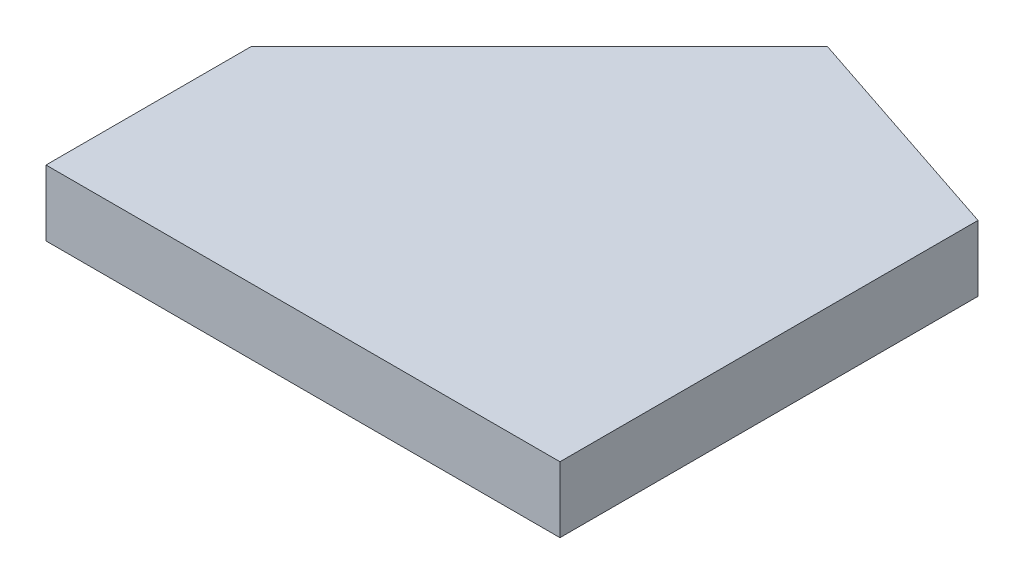
ISO-10303-21;
HEADER;
FILE_DESCRIPTION(('STEP AP214'),'2;1');
FILE_NAME('part.step','',(''),(''),'','','');
FILE_SCHEMA(('AUTOMOTIVE_DESIGN { 1 0 10303 214 1 1 1 1 }'));
ENDSEC;
DATA;
#1=APPLICATION_CONTEXT('core data for automotive mechanical design processes');
#2=APPLICATION_PROTOCOL_DEFINITION('international standard','automotive_design',2000,#1);
#3=PRODUCT_CONTEXT('',#1,'mechanical');
#4=PRODUCT('Part','Part','',(#3));
#5=PRODUCT_RELATED_PRODUCT_CATEGORY('part','',(#4));
#6=PRODUCT_DEFINITION_FORMATION('','',#4);
#7=PRODUCT_DEFINITION_CONTEXT('part definition',#1,'design');
#8=PRODUCT_DEFINITION('design','',#6,#7);
#9=PRODUCT_DEFINITION_SHAPE('','',#8);
#10=(LENGTH_UNIT() NAMED_UNIT(*) SI_UNIT(.MILLI.,.METRE.));
#11=(NAMED_UNIT(*) PLANE_ANGLE_UNIT() SI_UNIT($,.RADIAN.));
#12=(NAMED_UNIT(*) SI_UNIT($,.STERADIAN.) SOLID_ANGLE_UNIT());
#13=UNCERTAINTY_MEASURE_WITH_UNIT(LENGTH_MEASURE(1.E-05),#10,'distance_accuracy_value','');
#14=(GEOMETRIC_REPRESENTATION_CONTEXT(3) GLOBAL_UNCERTAINTY_ASSIGNED_CONTEXT((#13)) GLOBAL_UNIT_ASSIGNED_CONTEXT((#10,
#11,#12)) REPRESENTATION_CONTEXT('',''));
#15=CARTESIAN_POINT('',(0.,0.,0.));
#16=DIRECTION('',(0.,0.,1.));
#17=DIRECTION('',(1.,0.,0.));
#18=AXIS2_PLACEMENT_3D('',#15,#16,#17);
#19=CARTESIAN_POINT('',(0.,0.,0.));
#20=DIRECTION('',(0.,1.,0.));
#21=DIRECTION('',(0.,0.,1.));
#22=AXIS2_PLACEMENT_3D('',#19,#20,#21);
#23=PLANE('',#22);
#24=DIRECTION('',(-1.,0.,0.));
#25=VECTOR('',#24,1.);
#26=CARTESIAN_POINT('',(0.,0.,0.));
#27=LINE('',#26,#25);
#28=CARTESIAN_POINT('',(50.,0.,0.));
#29=VERTEX_POINT('',#28);
#30=CARTESIAN_POINT('',(0.,0.,0.));
#31=VERTEX_POINT('',#30);
#32=EDGE_CURVE('E93',#29,#31,#27,.T.);
#33=ORIENTED_EDGE('',*,*,#32,.T.);
#34=DIRECTION('',(0.,0.,1.));
#35=VECTOR('',#34,1.);
#36=CARTESIAN_POINT('',(0.,0.,0.));
#37=LINE('',#36,#35);
#38=CARTESIAN_POINT('',(0.,0.,-20.));
#39=VERTEX_POINT('',#38);
#40=EDGE_CURVE('E86',#39,#31,#37,.T.);
#41=ORIENTED_EDGE('',*,*,#40,.F.);
#42=DIRECTION('',(-0.707106781186548,0.,0.707106781186548));
#43=VECTOR('',#42,1.);
#44=CARTESIAN_POINT('',(-10.,0.,-10.));
#45=LINE('',#44,#43);
#46=CARTESIAN_POINT('',(28.0000000000001,0.,-48.0000000000001));
#47=VERTEX_POINT('',#46);
#48=EDGE_CURVE('E61',#47,#39,#45,.T.);
#49=ORIENTED_EDGE('',*,*,#48,.F.);
#50=DIRECTION('',(-0.948683298050513,0.,-0.316227766016841));
#51=VECTOR('',#50,1.);
#52=CARTESIAN_POINT('',(17.2000000000003,0.,-51.6000000000001));
#53=LINE('',#52,#51);
#54=CARTESIAN_POINT('',(50.,0.,-40.6666666666668));
#55=VERTEX_POINT('',#54);
#56=EDGE_CURVE('E63',#55,#47,#53,.T.);
#57=ORIENTED_EDGE('',*,*,#56,.F.);
#58=DIRECTION('',(0.,0.,-1.));
#59=VECTOR('',#58,1.);
#60=CARTESIAN_POINT('',(50.,0.,0.));
#61=LINE('',#60,#59);
#62=EDGE_CURVE('E20',#29,#55,#61,.T.);
#63=ORIENTED_EDGE('',*,*,#62,.F.);
#64=EDGE_LOOP('',(#33,#41,#49,#57,#63));
#65=FACE_BOUND('',#64,.T.);
#66=ADVANCED_FACE('F17',(#65),#23,.F.);
#67=CARTESIAN_POINT('',(50.,6.4,0.));
#68=DIRECTION('',(1.,0.,0.));
#69=DIRECTION('',(0.,0.,-1.));
#70=AXIS2_PLACEMENT_3D('',#67,#68,#69);
#71=PLANE('',#70);
#72=DIRECTION('',(0.,0.,1.));
#73=VECTOR('',#72,1.);
#74=CARTESIAN_POINT('',(50.,6.4,0.));
#75=LINE('',#74,#73);
#76=CARTESIAN_POINT('',(50.,6.4,0.));
#77=VERTEX_POINT('',#76);
#78=CARTESIAN_POINT('',(50.,6.4,-40.6666666666668));
#79=VERTEX_POINT('',#78);
#80=EDGE_CURVE('E95',#77,#79,#75,.F.);
#81=ORIENTED_EDGE('',*,*,#80,.F.);
#82=DIRECTION('',(0.,1.,0.));
#83=VECTOR('',#82,1.);
#84=CARTESIAN_POINT('',(50.,6.4,0.));
#85=LINE('',#84,#83);
#86=EDGE_CURVE('E75',#77,#29,#85,.F.);
#87=ORIENTED_EDGE('',*,*,#86,.T.);
#88=ORIENTED_EDGE('',*,*,#62,.T.);
#89=DIRECTION('',(0.,1.,0.));
#90=VECTOR('',#89,1.);
#91=CARTESIAN_POINT('',(50.,6.4,-40.6666666666668));
#92=LINE('',#91,#90);
#93=EDGE_CURVE('E70',#79,#55,#92,.F.);
#94=ORIENTED_EDGE('',*,*,#93,.F.);
#95=EDGE_LOOP('',(#81,#87,#88,#94));
#96=FACE_BOUND('',#95,.T.);
#97=ADVANCED_FACE('F72',(#96),#71,.T.);
#98=CARTESIAN_POINT('',(17.2000000000003,6.4,-51.6000000000001));
#99=DIRECTION('',(0.316227766016841,0.,-0.948683298050513));
#100=DIRECTION('',(-0.948683298050513,0.,-0.316227766016841));
#101=AXIS2_PLACEMENT_3D('',#98,#99,#100);
#102=PLANE('',#101);
#103=DIRECTION('',(-0.948683298050513,0.,-0.316227766016841));
#104=VECTOR('',#103,1.);
#105=CARTESIAN_POINT('',(50.,6.4,-40.6666666666668));
#106=LINE('',#105,#104);
#107=CARTESIAN_POINT('',(28.0000000000001,6.4,-48.0000000000001));
#108=VERTEX_POINT('',#107);
#109=EDGE_CURVE('E79',#79,#108,#106,.T.);
#110=ORIENTED_EDGE('',*,*,#109,.F.);
#111=ORIENTED_EDGE('',*,*,#93,.T.);
#112=ORIENTED_EDGE('',*,*,#56,.T.);
#113=DIRECTION('',(0.,1.,0.));
#114=VECTOR('',#113,1.);
#115=CARTESIAN_POINT('',(28.0000000000001,6.4,-48.0000000000001));
#116=LINE('',#115,#114);
#117=EDGE_CURVE('E82',#108,#47,#116,.F.);
#118=ORIENTED_EDGE('',*,*,#117,.F.);
#119=EDGE_LOOP('',(#110,#111,#112,#118));
#120=FACE_BOUND('',#119,.T.);
#121=ADVANCED_FACE('F77',(#120),#102,.T.);
#122=CARTESIAN_POINT('',(-10.,6.4,-10.));
#123=DIRECTION('',(-0.707106781186548,0.,-0.707106781186548));
#124=DIRECTION('',(-0.707106781186548,0.,0.707106781186548));
#125=AXIS2_PLACEMENT_3D('',#122,#123,#124);
#126=PLANE('',#125);
#127=DIRECTION('',(-0.707106781186547,0.,0.707106781186548));
#128=VECTOR('',#127,1.);
#129=CARTESIAN_POINT('',(28.0000000000001,6.4,-48.0000000000001));
#130=LINE('',#129,#128);
#131=CARTESIAN_POINT('',(0.,6.4,-20.));
#132=VERTEX_POINT('',#131);
#133=EDGE_CURVE('E98',#108,#132,#130,.T.);
#134=ORIENTED_EDGE('',*,*,#133,.F.);
#135=ORIENTED_EDGE('',*,*,#117,.T.);
#136=ORIENTED_EDGE('',*,*,#48,.T.);
#137=DIRECTION('',(0.,1.,0.));
#138=VECTOR('',#137,1.);
#139=CARTESIAN_POINT('',(0.,6.4,-20.));
#140=LINE('',#139,#138);
#141=EDGE_CURVE('E88',#132,#39,#140,.F.);
#142=ORIENTED_EDGE('',*,*,#141,.F.);
#143=EDGE_LOOP('',(#134,#135,#136,#142));
#144=FACE_BOUND('',#143,.T.);
#145=ADVANCED_FACE('F107',(#144),#126,.T.);
#146=CARTESIAN_POINT('',(0.,6.4,0.));
#147=DIRECTION('',(-1.,0.,0.));
#148=DIRECTION('',(0.,0.,1.));
#149=AXIS2_PLACEMENT_3D('',#146,#147,#148);
#150=PLANE('',#149);
#151=DIRECTION('',(0.,0.,1.));
#152=VECTOR('',#151,1.);
#153=CARTESIAN_POINT('',(0.,6.4,0.));
#154=LINE('',#153,#152);
#155=CARTESIAN_POINT('',(0.,6.4,0.));
#156=VERTEX_POINT('',#155);
#157=EDGE_CURVE('E26',#132,#156,#154,.T.);
#158=ORIENTED_EDGE('',*,*,#157,.F.);
#159=ORIENTED_EDGE('',*,*,#141,.T.);
#160=ORIENTED_EDGE('',*,*,#40,.T.);
#161=DIRECTION('',(0.,1.,0.));
#162=VECTOR('',#161,1.);
#163=CARTESIAN_POINT('',(0.,6.4,0.));
#164=LINE('',#163,#162);
#165=EDGE_CURVE('E35',#31,#156,#164,.T.);
#166=ORIENTED_EDGE('',*,*,#165,.T.);
#167=EDGE_LOOP('',(#158,#159,#160,#166));
#168=FACE_BOUND('',#167,.T.);
#169=ADVANCED_FACE('F105',(#168),#150,.T.);
#170=CARTESIAN_POINT('',(0.,6.4,0.));
#171=DIRECTION('',(0.,0.,-1.));
#172=DIRECTION('',(-1.,0.,0.));
#173=AXIS2_PLACEMENT_3D('',#170,#171,#172);
#174=PLANE('',#173);
#175=ORIENTED_EDGE('',*,*,#86,.F.);
#176=DIRECTION('',(1.,0.,0.));
#177=VECTOR('',#176,1.);
#178=CARTESIAN_POINT('',(0.,6.4,0.));
#179=LINE('',#178,#177);
#180=EDGE_CURVE('E11',#156,#77,#179,.T.);
#181=ORIENTED_EDGE('',*,*,#180,.F.);
#182=ORIENTED_EDGE('',*,*,#165,.F.);
#183=ORIENTED_EDGE('',*,*,#32,.F.);
#184=EDGE_LOOP('',(#175,#181,#182,#183));
#185=FACE_BOUND('',#184,.T.);
#186=ADVANCED_FACE('F109',(#185),#174,.F.);
#187=CARTESIAN_POINT('',(0.,6.4,0.));
#188=DIRECTION('',(0.,1.,0.));
#189=DIRECTION('',(0.,0.,1.));
#190=AXIS2_PLACEMENT_3D('',#187,#188,#189);
#191=PLANE('',#190);
#192=ORIENTED_EDGE('',*,*,#157,.T.);
#193=ORIENTED_EDGE('',*,*,#180,.T.);
#194=ORIENTED_EDGE('',*,*,#80,.T.);
#195=ORIENTED_EDGE('',*,*,#109,.T.);
#196=ORIENTED_EDGE('',*,*,#133,.T.);
#197=EDGE_LOOP('',(#192,#193,#194,#195,#196));
#198=FACE_BOUND('',#197,.T.);
#199=ADVANCED_FACE('F103',(#198),#191,.T.);
#200=CLOSED_SHELL('',(#66,#97,#121,#145,#169,#186,#199));
#201=MANIFOLD_SOLID_BREP('B1',#200);
#202=ADVANCED_BREP_SHAPE_REPRESENTATION('',(#18,#201),#14);
#203=SHAPE_DEFINITION_REPRESENTATION(#9,#202);
ENDSEC;
END-ISO-10303-21;
